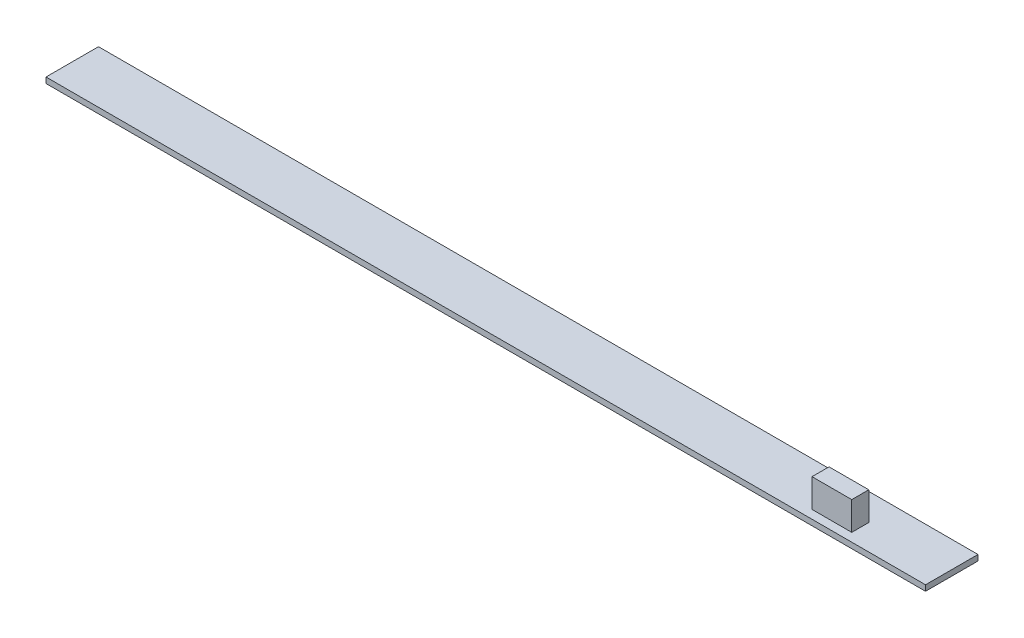
ISO-10303-21;
HEADER;
FILE_DESCRIPTION(('STEP AP214'),'2;1');
FILE_NAME('part.step','',(''),(''),'','','');
FILE_SCHEMA(('AUTOMOTIVE_DESIGN { 1 0 10303 214 1 1 1 1 }'));
ENDSEC;
DATA;
#1=APPLICATION_CONTEXT('core data for automotive mechanical design processes');
#2=APPLICATION_PROTOCOL_DEFINITION('international standard','automotive_design',2000,#1);
#3=PRODUCT_CONTEXT('',#1,'mechanical');
#4=PRODUCT('Part','Part','',(#3));
#5=PRODUCT_RELATED_PRODUCT_CATEGORY('part','',(#4));
#6=PRODUCT_DEFINITION_FORMATION('','',#4);
#7=PRODUCT_DEFINITION_CONTEXT('part definition',#1,'design');
#8=PRODUCT_DEFINITION('design','',#6,#7);
#9=PRODUCT_DEFINITION_SHAPE('','',#8);
#10=(LENGTH_UNIT() NAMED_UNIT(*) SI_UNIT(.MILLI.,.METRE.));
#11=(NAMED_UNIT(*) PLANE_ANGLE_UNIT() SI_UNIT($,.RADIAN.));
#12=(NAMED_UNIT(*) SI_UNIT($,.STERADIAN.) SOLID_ANGLE_UNIT());
#13=UNCERTAINTY_MEASURE_WITH_UNIT(LENGTH_MEASURE(1.E-05),#10,'distance_accuracy_value','');
#14=(GEOMETRIC_REPRESENTATION_CONTEXT(3) GLOBAL_UNCERTAINTY_ASSIGNED_CONTEXT((#13)) GLOBAL_UNIT_ASSIGNED_CONTEXT((#10,
#11,#12)) REPRESENTATION_CONTEXT('',''));
#15=CARTESIAN_POINT('',(0.,0.,0.));
#16=DIRECTION('',(0.,0.,1.));
#17=DIRECTION('',(1.,0.,0.));
#18=AXIS2_PLACEMENT_3D('',#15,#16,#17);
#19=CARTESIAN_POINT('',(627.09224857648,93.3157017452683,38.768969390047));
#20=DIRECTION('',(0.,1.,0.));
#21=DIRECTION('',(0.,0.,1.));
#22=AXIS2_PLACEMENT_3D('',#19,#20,#21);
#23=PLANE('',#22);
#24=DIRECTION('',(0.,0.,-1.));
#25=VECTOR('',#24,1.);
#26=CARTESIAN_POINT('',(688.394917120642,93.3157017452683,109.998911751353));
#27=LINE('',#26,#25);
#28=CARTESIAN_POINT('',(688.394917120642,93.3157017452683,106.998911751353));
#29=VERTEX_POINT('',#28);
#30=CARTESIAN_POINT('',(688.394917120642,93.3157017452683,109.998911751353));
#31=VERTEX_POINT('',#30);
#32=EDGE_CURVE('E80',#29,#31,#27,.F.);
#33=ORIENTED_EDGE('',*,*,#32,.F.);
#34=DIRECTION('',(-1.,0.,0.));
#35=VECTOR('',#34,1.);
#36=CARTESIAN_POINT('',(688.394917120642,93.3157017452683,106.998911751353));
#37=LINE('',#36,#35);
#38=CARTESIAN_POINT('',(681.394917120642,93.3157017452683,106.998911751353));
#39=VERTEX_POINT('',#38);
#40=EDGE_CURVE('E20',#39,#29,#37,.F.);
#41=ORIENTED_EDGE('',*,*,#40,.F.);
#42=DIRECTION('',(0.,0.,1.));
#43=VECTOR('',#42,1.);
#44=CARTESIAN_POINT('',(681.394917120642,93.3157017452683,106.998911751353));
#45=LINE('',#44,#43);
#46=CARTESIAN_POINT('',(681.394917120642,93.3157017452683,109.998911751353));
#47=VERTEX_POINT('',#46);
#48=EDGE_CURVE('E103',#47,#39,#45,.F.);
#49=ORIENTED_EDGE('',*,*,#48,.F.);
#50=DIRECTION('',(1.,0.,0.));
#51=VECTOR('',#50,1.);
#52=CARTESIAN_POINT('',(681.394917120642,93.3157017452683,109.998911751353));
#53=LINE('',#52,#51);
#54=EDGE_CURVE('E96',#31,#47,#53,.F.);
#55=ORIENTED_EDGE('',*,*,#54,.F.);
#56=EDGE_LOOP('',(#33,#41,#49,#55));
#57=FACE_BOUND('',#56,.T.);
#58=ADVANCED_FACE('F17',(#57),#23,.T.);
#59=CARTESIAN_POINT('',(688.394917120642,93.3157017452683,106.998911751353));
#60=DIRECTION('',(0.,0.,-1.));
#61=DIRECTION('',(-1.,0.,0.));
#62=AXIS2_PLACEMENT_3D('',#59,#60,#61);
#63=PLANE('',#62);
#64=DIRECTION('',(1.,0.,0.));
#65=VECTOR('',#64,1.);
#66=CARTESIAN_POINT('',(627.09224857648,88.3157017452683,106.998911751353));
#67=LINE('',#66,#65);
#68=CARTESIAN_POINT('',(681.394917120642,88.3157017452683,106.998911751353));
#69=VERTEX_POINT('',#68);
#70=CARTESIAN_POINT('',(688.394917120642,88.3157017452683,106.998911751353));
#71=VERTEX_POINT('',#70);
#72=EDGE_CURVE('E109',#69,#71,#67,.T.);
#73=ORIENTED_EDGE('',*,*,#72,.F.);
#74=DIRECTION('',(0.,1.,0.));
#75=VECTOR('',#74,1.);
#76=CARTESIAN_POINT('',(681.394917120642,93.3157017452683,106.998911751353));
#77=LINE('',#76,#75);
#78=EDGE_CURVE('E91',#39,#69,#77,.F.);
#79=ORIENTED_EDGE('',*,*,#78,.F.);
#80=ORIENTED_EDGE('',*,*,#40,.T.);
#81=DIRECTION('',(0.,1.,0.));
#82=VECTOR('',#81,1.);
#83=CARTESIAN_POINT('',(688.394917120642,93.3157017452683,106.998911751353));
#84=LINE('',#83,#82);
#85=EDGE_CURVE('E89',#71,#29,#84,.T.);
#86=ORIENTED_EDGE('',*,*,#85,.F.);
#87=EDGE_LOOP('',(#73,#79,#80,#86));
#88=FACE_BOUND('',#87,.T.);
#89=ADVANCED_FACE('F88',(#88),#63,.T.);
#90=CARTESIAN_POINT('',(688.394917120642,93.3157017452683,109.998911751353));
#91=DIRECTION('',(1.,0.,0.));
#92=DIRECTION('',(0.,0.,-1.));
#93=AXIS2_PLACEMENT_3D('',#90,#91,#92);
#94=PLANE('',#93);
#95=DIRECTION('',(0.,0.,1.));
#96=VECTOR('',#95,1.);
#97=CARTESIAN_POINT('',(688.394917120642,88.3157017452683,38.768969390047));
#98=LINE('',#97,#96);
#99=CARTESIAN_POINT('',(688.394917120642,88.3157017452683,109.998911751353));
#100=VERTEX_POINT('',#99);
#101=EDGE_CURVE('E95',#71,#100,#98,.T.);
#102=ORIENTED_EDGE('',*,*,#101,.F.);
#103=ORIENTED_EDGE('',*,*,#85,.T.);
#104=ORIENTED_EDGE('',*,*,#32,.T.);
#105=DIRECTION('',(0.,1.,0.));
#106=VECTOR('',#105,1.);
#107=CARTESIAN_POINT('',(688.394917120642,93.3157017452683,109.998911751353));
#108=LINE('',#107,#106);
#109=EDGE_CURVE('E101',#100,#31,#108,.T.);
#110=ORIENTED_EDGE('',*,*,#109,.F.);
#111=EDGE_LOOP('',(#102,#103,#104,#110));
#112=FACE_BOUND('',#111,.T.);
#113=ADVANCED_FACE('F94',(#112),#94,.T.);
#114=CARTESIAN_POINT('',(681.394917120642,93.3157017452683,109.998911751353));
#115=DIRECTION('',(0.,0.,1.));
#116=DIRECTION('',(1.,0.,0.));
#117=AXIS2_PLACEMENT_3D('',#114,#115,#116);
#118=PLANE('',#117);
#119=DIRECTION('',(1.,0.,0.));
#120=VECTOR('',#119,1.);
#121=CARTESIAN_POINT('',(627.09224857648,88.3157017452683,109.998911751353));
#122=LINE('',#121,#120);
#123=CARTESIAN_POINT('',(681.394917120642,88.3157017452683,109.998911751353));
#124=VERTEX_POINT('',#123);
#125=EDGE_CURVE('E112',#100,#124,#122,.F.);
#126=ORIENTED_EDGE('',*,*,#125,.F.);
#127=ORIENTED_EDGE('',*,*,#109,.T.);
#128=ORIENTED_EDGE('',*,*,#54,.T.);
#129=DIRECTION('',(0.,1.,0.));
#130=VECTOR('',#129,1.);
#131=CARTESIAN_POINT('',(681.394917120642,93.3157017452683,109.998911751353));
#132=LINE('',#131,#130);
#133=EDGE_CURVE('E106',#124,#47,#132,.T.);
#134=ORIENTED_EDGE('',*,*,#133,.F.);
#135=EDGE_LOOP('',(#126,#127,#128,#134));
#136=FACE_BOUND('',#135,.T.);
#137=ADVANCED_FACE('F178',(#136),#118,.T.);
#138=CARTESIAN_POINT('',(681.394917120642,93.3157017452683,106.998911751353));
#139=DIRECTION('',(-1.,0.,0.));
#140=DIRECTION('',(0.,0.,1.));
#141=AXIS2_PLACEMENT_3D('',#138,#139,#140);
#142=PLANE('',#141);
#143=DIRECTION('',(0.,0.,1.));
#144=VECTOR('',#143,1.);
#145=CARTESIAN_POINT('',(681.394917120642,88.3157017452683,38.768969390047));
#146=LINE('',#145,#144);
#147=EDGE_CURVE('E114',#124,#69,#146,.F.);
#148=ORIENTED_EDGE('',*,*,#147,.F.);
#149=ORIENTED_EDGE('',*,*,#133,.T.);
#150=ORIENTED_EDGE('',*,*,#48,.T.);
#151=ORIENTED_EDGE('',*,*,#78,.T.);
#152=EDGE_LOOP('',(#148,#149,#150,#151));
#153=FACE_BOUND('',#152,.T.);
#154=ADVANCED_FACE('F174',(#153),#142,.T.);
#155=CARTESIAN_POINT('',(627.09224857648,88.3157017452683,38.768969390047));
#156=DIRECTION('',(0.,1.,0.));
#157=DIRECTION('',(0.,0.,1.));
#158=AXIS2_PLACEMENT_3D('',#155,#156,#157);
#159=PLANE('',#158);
#160=ORIENTED_EDGE('',*,*,#125,.T.);
#161=ORIENTED_EDGE('',*,*,#147,.T.);
#162=ORIENTED_EDGE('',*,*,#72,.T.);
#163=ORIENTED_EDGE('',*,*,#101,.T.);
#164=EDGE_LOOP('',(#160,#161,#162,#163));
#165=FACE_BOUND('',#164,.T.);
#166=DIRECTION('',(0.,0.,-1.));
#167=VECTOR('',#166,1.);
#168=CARTESIAN_POINT('',(702.894917120642,88.3157017452683,51.4989117513526));
#169=LINE('',#168,#167);
#170=CARTESIAN_POINT('',(702.894917120642,88.3157017452683,102.248911751353));
#171=VERTEX_POINT('',#170);
#172=CARTESIAN_POINT('',(702.894917120642,88.3157017452683,111.498911751353));
#173=VERTEX_POINT('',#172);
#174=EDGE_CURVE('E123',#171,#173,#169,.F.);
#175=ORIENTED_EDGE('',*,*,#174,.F.);
#176=DIRECTION('',(1.,0.,0.));
#177=VECTOR('',#176,1.);
#178=CARTESIAN_POINT('',(716.961413,88.3157017452683,102.248911751353));
#179=LINE('',#178,#177);
#180=CARTESIAN_POINT('',(547.894917120642,88.3157017452683,102.248911751353));
#181=VERTEX_POINT('',#180);
#182=EDGE_CURVE('E128',#171,#181,#179,.F.);
#183=ORIENTED_EDGE('',*,*,#182,.T.);
#184=DIRECTION('',(0.,0.,1.));
#185=VECTOR('',#184,1.);
#186=CARTESIAN_POINT('',(547.894917120642,88.3157017452683,111.498911751353));
#187=LINE('',#186,#185);
#188=CARTESIAN_POINT('',(547.894917120642,88.3157017452683,111.498911751353));
#189=VERTEX_POINT('',#188);
#190=EDGE_CURVE('E117',#189,#181,#187,.F.);
#191=ORIENTED_EDGE('',*,*,#190,.F.);
#192=DIRECTION('',(1.,0.,0.));
#193=VECTOR('',#192,1.);
#194=CARTESIAN_POINT('',(702.894917120642,88.3157017452683,111.498911751353));
#195=LINE('',#194,#193);
#196=EDGE_CURVE('E119',#173,#189,#195,.F.);
#197=ORIENTED_EDGE('',*,*,#196,.F.);
#198=EDGE_LOOP('',(#175,#183,#191,#197));
#199=FACE_BOUND('',#198,.T.);
#200=ADVANCED_FACE('F171',(#165,#199),#159,.T.);
#201=CARTESIAN_POINT('',(547.894917120642,87.3157017452683,111.498911751353));
#202=DIRECTION('',(-1.,0.,0.));
#203=DIRECTION('',(0.,0.,1.));
#204=AXIS2_PLACEMENT_3D('',#201,#202,#203);
#205=PLANE('',#204);
#206=ORIENTED_EDGE('',*,*,#190,.T.);
#207=DIRECTION('',(0.,1.,0.));
#208=VECTOR('',#207,1.);
#209=CARTESIAN_POINT('',(547.894917120642,86.7156777452683,102.248911751353));
#210=LINE('',#209,#208);
#211=CARTESIAN_POINT('',(547.894917120642,87.3157017452683,102.248911751353));
#212=VERTEX_POINT('',#211);
#213=EDGE_CURVE('E131',#181,#212,#210,.F.);
#214=ORIENTED_EDGE('',*,*,#213,.T.);
#215=DIRECTION('',(0.,0.,1.));
#216=VECTOR('',#215,1.);
#217=CARTESIAN_POINT('',(547.894917120642,87.3157017452683,38.768969390047));
#218=LINE('',#217,#216);
#219=CARTESIAN_POINT('',(547.894917120642,87.3157017452683,111.498911751353));
#220=VERTEX_POINT('',#219);
#221=EDGE_CURVE('E134',#212,#220,#218,.T.);
#222=ORIENTED_EDGE('',*,*,#221,.T.);
#223=DIRECTION('',(0.,1.,0.));
#224=VECTOR('',#223,1.);
#225=CARTESIAN_POINT('',(547.894917120642,87.3157017452683,111.498911751353));
#226=LINE('',#225,#224);
#227=EDGE_CURVE('E121',#189,#220,#226,.F.);
#228=ORIENTED_EDGE('',*,*,#227,.F.);
#229=EDGE_LOOP('',(#206,#214,#222,#228));
#230=FACE_BOUND('',#229,.T.);
#231=ADVANCED_FACE('F154',(#230),#205,.T.);
#232=CARTESIAN_POINT('',(702.894917120642,87.3157017452683,111.498911751353));
#233=DIRECTION('',(0.,0.,1.));
#234=DIRECTION('',(1.,0.,0.));
#235=AXIS2_PLACEMENT_3D('',#232,#233,#234);
#236=PLANE('',#235);
#237=ORIENTED_EDGE('',*,*,#196,.T.);
#238=ORIENTED_EDGE('',*,*,#227,.T.);
#239=DIRECTION('',(1.,0.,0.));
#240=VECTOR('',#239,1.);
#241=CARTESIAN_POINT('',(627.09224857648,87.3157017452683,111.498911751353));
#242=LINE('',#241,#240);
#243=CARTESIAN_POINT('',(702.894917120642,87.3157017452683,111.498911751353));
#244=VERTEX_POINT('',#243);
#245=EDGE_CURVE('E137',#220,#244,#242,.T.);
#246=ORIENTED_EDGE('',*,*,#245,.T.);
#247=DIRECTION('',(0.,1.,0.));
#248=VECTOR('',#247,1.);
#249=CARTESIAN_POINT('',(702.894917120642,87.3157017452683,111.498911751353));
#250=LINE('',#249,#248);
#251=EDGE_CURVE('E125',#173,#244,#250,.F.);
#252=ORIENTED_EDGE('',*,*,#251,.F.);
#253=EDGE_LOOP('',(#237,#238,#246,#252));
#254=FACE_BOUND('',#253,.T.);
#255=ADVANCED_FACE('F149',(#254),#236,.T.);
#256=CARTESIAN_POINT('',(702.894917120642,87.3157017452683,51.4989117513526));
#257=DIRECTION('',(1.,0.,0.));
#258=DIRECTION('',(0.,0.,-1.));
#259=AXIS2_PLACEMENT_3D('',#256,#257,#258);
#260=PLANE('',#259);
#261=ORIENTED_EDGE('',*,*,#251,.T.);
#262=DIRECTION('',(0.,0.,1.));
#263=VECTOR('',#262,1.);
#264=CARTESIAN_POINT('',(702.894917120642,87.3157017452683,38.768969390047));
#265=LINE('',#264,#263);
#266=CARTESIAN_POINT('',(702.894917120642,87.3157017452683,102.248911751353));
#267=VERTEX_POINT('',#266);
#268=EDGE_CURVE('E26',#244,#267,#265,.F.);
#269=ORIENTED_EDGE('',*,*,#268,.T.);
#270=DIRECTION('',(0.,1.,0.));
#271=VECTOR('',#270,1.);
#272=CARTESIAN_POINT('',(702.894917120642,86.7156777452683,102.248911751353));
#273=LINE('',#272,#271);
#274=EDGE_CURVE('E34',#267,#171,#273,.T.);
#275=ORIENTED_EDGE('',*,*,#274,.T.);
#276=ORIENTED_EDGE('',*,*,#174,.T.);
#277=EDGE_LOOP('',(#261,#269,#275,#276));
#278=FACE_BOUND('',#277,.T.);
#279=ADVANCED_FACE('F143',(#278),#260,.T.);
#280=CARTESIAN_POINT('',(716.961413,86.7156777452683,102.248911751353));
#281=DIRECTION('',(0.,0.,1.));
#282=DIRECTION('',(1.,0.,0.));
#283=AXIS2_PLACEMENT_3D('',#280,#281,#282);
#284=PLANE('',#283);
#285=ORIENTED_EDGE('',*,*,#182,.F.);
#286=ORIENTED_EDGE('',*,*,#274,.F.);
#287=DIRECTION('',(1.,0.,0.));
#288=VECTOR('',#287,1.);
#289=CARTESIAN_POINT('',(627.09224857648,87.3157017452683,102.248911751353));
#290=LINE('',#289,#288);
#291=EDGE_CURVE('E11',#267,#212,#290,.F.);
#292=ORIENTED_EDGE('',*,*,#291,.T.);
#293=ORIENTED_EDGE('',*,*,#213,.F.);
#294=EDGE_LOOP('',(#285,#286,#292,#293));
#295=FACE_BOUND('',#294,.T.);
#296=ADVANCED_FACE('F156',(#295),#284,.F.);
#297=CARTESIAN_POINT('',(627.09224857648,87.3157017452683,38.768969390047));
#298=DIRECTION('',(0.,1.,0.));
#299=DIRECTION('',(0.,0.,1.));
#300=AXIS2_PLACEMENT_3D('',#297,#298,#299);
#301=PLANE('',#300);
#302=ORIENTED_EDGE('',*,*,#268,.F.);
#303=ORIENTED_EDGE('',*,*,#245,.F.);
#304=ORIENTED_EDGE('',*,*,#221,.F.);
#305=ORIENTED_EDGE('',*,*,#291,.F.);
#306=EDGE_LOOP('',(#302,#303,#304,#305));
#307=FACE_BOUND('',#306,.T.);
#308=ADVANCED_FACE('F147',(#307),#301,.F.);
#309=CLOSED_SHELL('',(#58,#89,#113,#137,#154,#200,#231,#255,#279,#296,#308));
#310=MANIFOLD_SOLID_BREP('B1',#309);
#311=ADVANCED_BREP_SHAPE_REPRESENTATION('',(#18,#310),#14);
#312=SHAPE_DEFINITION_REPRESENTATION(#9,#311);
ENDSEC;
END-ISO-10303-21;
